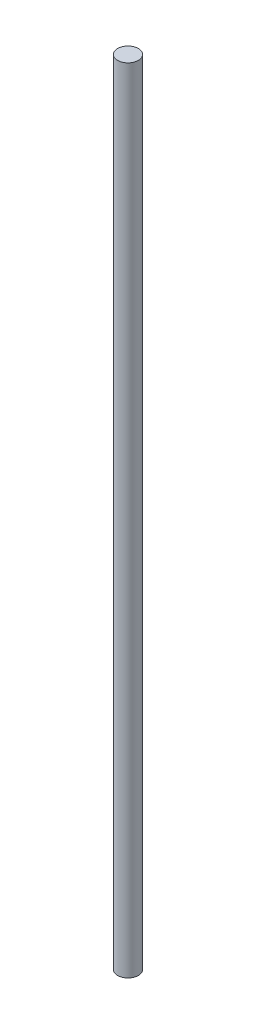
ISO-10303-21;
HEADER;
FILE_DESCRIPTION(('STEP AP214'),'2;1');
FILE_NAME('part.step','',(''),(''),'','','');
FILE_SCHEMA(('AUTOMOTIVE_DESIGN { 1 0 10303 214 1 1 1 1 }'));
ENDSEC;
DATA;
#1=APPLICATION_CONTEXT('core data for automotive mechanical design processes');
#2=APPLICATION_PROTOCOL_DEFINITION('international standard','automotive_design',2000,#1);
#3=PRODUCT_CONTEXT('',#1,'mechanical');
#4=PRODUCT('Part','Part','',(#3));
#5=PRODUCT_RELATED_PRODUCT_CATEGORY('part','',(#4));
#6=PRODUCT_DEFINITION_FORMATION('','',#4);
#7=PRODUCT_DEFINITION_CONTEXT('part definition',#1,'design');
#8=PRODUCT_DEFINITION('design','',#6,#7);
#9=PRODUCT_DEFINITION_SHAPE('','',#8);
#10=(LENGTH_UNIT() NAMED_UNIT(*) SI_UNIT(.MILLI.,.METRE.));
#11=(NAMED_UNIT(*) PLANE_ANGLE_UNIT() SI_UNIT($,.RADIAN.));
#12=(NAMED_UNIT(*) SI_UNIT($,.STERADIAN.) SOLID_ANGLE_UNIT());
#13=UNCERTAINTY_MEASURE_WITH_UNIT(LENGTH_MEASURE(1.E-05),#10,'distance_accuracy_value','');
#14=(GEOMETRIC_REPRESENTATION_CONTEXT(3) GLOBAL_UNCERTAINTY_ASSIGNED_CONTEXT((#13)) GLOBAL_UNIT_ASSIGNED_CONTEXT((#10,
#11,#12)) REPRESENTATION_CONTEXT('',''));
#15=CARTESIAN_POINT('',(0.,0.,0.));
#16=DIRECTION('',(0.,0.,1.));
#17=DIRECTION('',(1.,0.,0.));
#18=AXIS2_PLACEMENT_3D('',#15,#16,#17);
#19=CARTESIAN_POINT('',(0.,23.,0.));
#20=DIRECTION('',(0.,-1.,0.));
#21=DIRECTION('',(0.,0.,-1.));
#22=AXIS2_PLACEMENT_3D('',#19,#20,#21);
#23=CYLINDRICAL_SURFACE('',#22,0.3);
#24=CARTESIAN_POINT('',(0.,23.,0.));
#25=DIRECTION('',(0.,1.,0.));
#26=DIRECTION('',(0.,0.,1.));
#27=AXIS2_PLACEMENT_3D('',#24,#25,#26);
#28=CIRCLE('',#27,0.3);
#29=CARTESIAN_POINT('',(0.,23.,0.3));
#30=VERTEX_POINT('',#29);
#31=EDGE_CURVE('E10',#30,#30,#28,.T.);
#32=ORIENTED_EDGE('',*,*,#31,.F.);
#33=EDGE_LOOP('',(#32));
#34=FACE_BOUND('',#33,.T.);
#35=CARTESIAN_POINT('',(0.,0.,0.));
#36=DIRECTION('',(0.,1.,0.));
#37=DIRECTION('',(0.,0.,1.));
#38=AXIS2_PLACEMENT_3D('',#35,#36,#37);
#39=CIRCLE('',#38,0.3);
#40=CARTESIAN_POINT('',(0.,0.,0.3));
#41=VERTEX_POINT('',#40);
#42=EDGE_CURVE('E34',#41,#41,#39,.T.);
#43=ORIENTED_EDGE('',*,*,#42,.T.);
#44=EDGE_LOOP('',(#43));
#45=FACE_BOUND('',#44,.T.);
#46=ADVANCED_FACE('F31',(#34,#45),#23,.T.);
#47=CARTESIAN_POINT('',(0.,23.,0.));
#48=DIRECTION('',(0.,1.,0.));
#49=DIRECTION('',(0.,0.,1.));
#50=AXIS2_PLACEMENT_3D('',#47,#48,#49);
#51=PLANE('',#50);
#52=ORIENTED_EDGE('',*,*,#31,.T.);
#53=EDGE_LOOP('',(#52));
#54=FACE_BOUND('',#53,.T.);
#55=ADVANCED_FACE('F46',(#54),#51,.T.);
#56=CARTESIAN_POINT('',(0.,0.,0.));
#57=DIRECTION('',(0.,1.,0.));
#58=DIRECTION('',(0.,0.,1.));
#59=AXIS2_PLACEMENT_3D('',#56,#57,#58);
#60=PLANE('',#59);
#61=ORIENTED_EDGE('',*,*,#42,.F.);
#62=EDGE_LOOP('',(#61));
#63=FACE_BOUND('',#62,.T.);
#64=ADVANCED_FACE('F44',(#63),#60,.F.);
#65=CLOSED_SHELL('',(#46,#55,#64));
#66=MANIFOLD_SOLID_BREP('B2',#65);
#67=ADVANCED_BREP_SHAPE_REPRESENTATION('',(#18,#66),#14);
#68=SHAPE_DEFINITION_REPRESENTATION(#9,#67);
ENDSEC;
END-ISO-10303-21;
